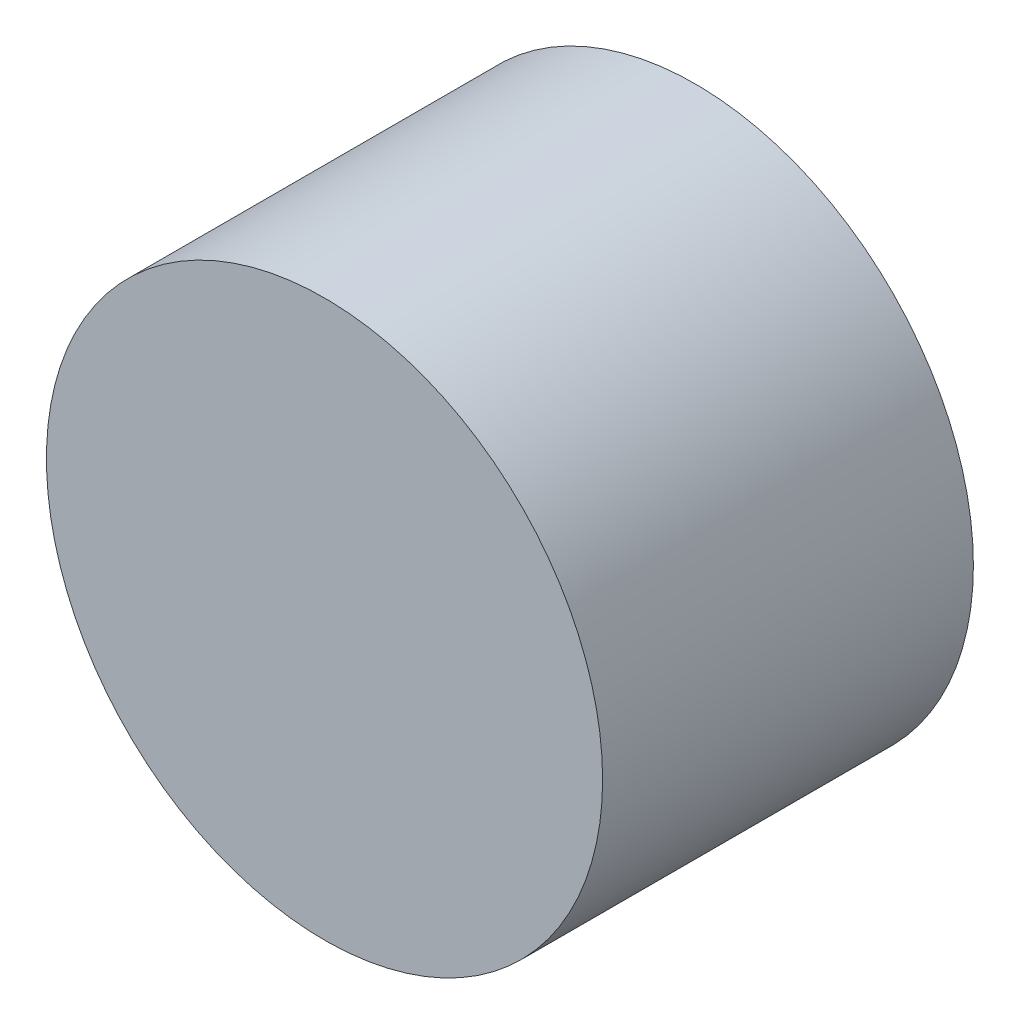
ISO-10303-21;
HEADER;
FILE_DESCRIPTION(('STEP AP214'),'2;1');
FILE_NAME('part.step','',(''),(''),'','','');
FILE_SCHEMA(('AUTOMOTIVE_DESIGN { 1 0 10303 214 1 1 1 1 }'));
ENDSEC;
DATA;
#1=APPLICATION_CONTEXT('core data for automotive mechanical design processes');
#2=APPLICATION_PROTOCOL_DEFINITION('international standard','automotive_design',2000,#1);
#3=PRODUCT_CONTEXT('',#1,'mechanical');
#4=PRODUCT('Part','Part','',(#3));
#5=PRODUCT_RELATED_PRODUCT_CATEGORY('part','',(#4));
#6=PRODUCT_DEFINITION_FORMATION('','',#4);
#7=PRODUCT_DEFINITION_CONTEXT('part definition',#1,'design');
#8=PRODUCT_DEFINITION('design','',#6,#7);
#9=PRODUCT_DEFINITION_SHAPE('','',#8);
#10=(LENGTH_UNIT() NAMED_UNIT(*) SI_UNIT(.MILLI.,.METRE.));
#11=(NAMED_UNIT(*) PLANE_ANGLE_UNIT() SI_UNIT($,.RADIAN.));
#12=(NAMED_UNIT(*) SI_UNIT($,.STERADIAN.) SOLID_ANGLE_UNIT());
#13=UNCERTAINTY_MEASURE_WITH_UNIT(LENGTH_MEASURE(1.E-05),#10,'distance_accuracy_value','');
#14=(GEOMETRIC_REPRESENTATION_CONTEXT(3) GLOBAL_UNCERTAINTY_ASSIGNED_CONTEXT((#13)) GLOBAL_UNIT_ASSIGNED_CONTEXT((#10,
#11,#12)) REPRESENTATION_CONTEXT('',''));
#15=CARTESIAN_POINT('',(0.,0.,0.));
#16=DIRECTION('',(0.,0.,1.));
#17=DIRECTION('',(1.,0.,0.));
#18=AXIS2_PLACEMENT_3D('',#15,#16,#17);
#19=CARTESIAN_POINT('',(0.,0.,100.));
#20=DIRECTION('',(0.,0.,-1.));
#21=DIRECTION('',(-1.,0.,0.));
#22=AXIS2_PLACEMENT_3D('',#19,#20,#21);
#23=CYLINDRICAL_SURFACE('',#22,75.);
#24=CARTESIAN_POINT('',(0.,0.,100.));
#25=DIRECTION('',(0.,0.,1.));
#26=DIRECTION('',(1.,0.,0.));
#27=AXIS2_PLACEMENT_3D('',#24,#25,#26);
#28=CIRCLE('',#27,75.);
#29=CARTESIAN_POINT('',(75.,0.,100.));
#30=VERTEX_POINT('',#29);
#31=EDGE_CURVE('E10',#30,#30,#28,.T.);
#32=ORIENTED_EDGE('',*,*,#31,.F.);
#33=EDGE_LOOP('',(#32));
#34=FACE_BOUND('',#33,.T.);
#35=CARTESIAN_POINT('',(0.,0.,0.));
#36=DIRECTION('',(0.,0.,1.));
#37=DIRECTION('',(1.,0.,0.));
#38=AXIS2_PLACEMENT_3D('',#35,#36,#37);
#39=CIRCLE('',#38,75.);
#40=CARTESIAN_POINT('',(75.,0.,0.));
#41=VERTEX_POINT('',#40);
#42=EDGE_CURVE('E37',#41,#41,#39,.T.);
#43=ORIENTED_EDGE('',*,*,#42,.T.);
#44=EDGE_LOOP('',(#43));
#45=FACE_BOUND('',#44,.T.);
#46=ADVANCED_FACE('F34',(#34,#45),#23,.T.);
#47=CARTESIAN_POINT('',(0.,0.,100.));
#48=DIRECTION('',(0.,0.,1.));
#49=DIRECTION('',(1.,0.,0.));
#50=AXIS2_PLACEMENT_3D('',#47,#48,#49);
#51=PLANE('',#50);
#52=ORIENTED_EDGE('',*,*,#31,.T.);
#53=EDGE_LOOP('',(#52));
#54=FACE_BOUND('',#53,.T.);
#55=ADVANCED_FACE('F49',(#54),#51,.T.);
#56=CARTESIAN_POINT('',(0.,0.,0.));
#57=DIRECTION('',(0.,0.,1.));
#58=DIRECTION('',(1.,0.,0.));
#59=AXIS2_PLACEMENT_3D('',#56,#57,#58);
#60=PLANE('',#59);
#61=ORIENTED_EDGE('',*,*,#42,.F.);
#62=EDGE_LOOP('',(#61));
#63=FACE_BOUND('',#62,.T.);
#64=ADVANCED_FACE('F47',(#63),#60,.F.);
#65=CLOSED_SHELL('',(#46,#55,#64));
#66=MANIFOLD_SOLID_BREP('B2',#65);
#67=ADVANCED_BREP_SHAPE_REPRESENTATION('',(#18,#66),#14);
#68=SHAPE_DEFINITION_REPRESENTATION(#9,#67);
ENDSEC;
END-ISO-10303-21;
